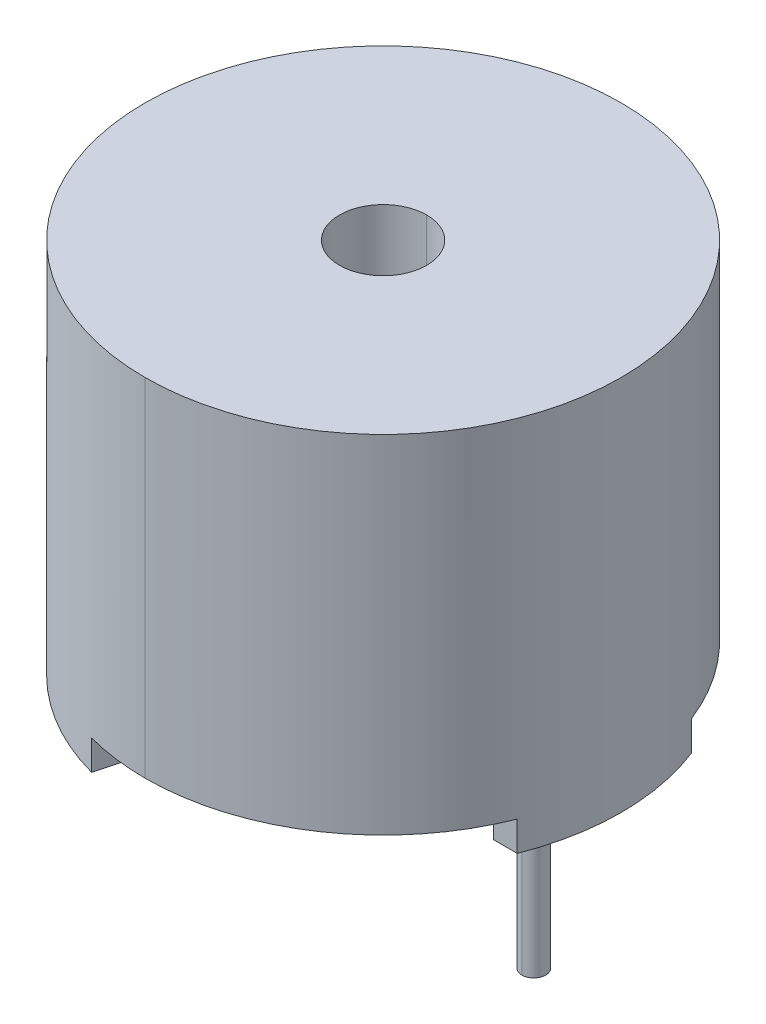
ISO-10303-21;
HEADER;
FILE_DESCRIPTION(('STEP AP214'),'2;1');
FILE_NAME('part.step','',(''),(''),'','','');
FILE_SCHEMA(('AUTOMOTIVE_DESIGN { 1 0 10303 214 1 1 1 1 }'));
ENDSEC;
DATA;
#1=APPLICATION_CONTEXT('core data for automotive mechanical design processes');
#2=APPLICATION_PROTOCOL_DEFINITION('international standard','automotive_design',2000,#1);
#3=PRODUCT_CONTEXT('',#1,'mechanical');
#4=PRODUCT('Part','Part','',(#3));
#5=PRODUCT_RELATED_PRODUCT_CATEGORY('part','',(#4));
#6=PRODUCT_DEFINITION_FORMATION('','',#4);
#7=PRODUCT_DEFINITION_CONTEXT('part definition',#1,'design');
#8=PRODUCT_DEFINITION('design','',#6,#7);
#9=PRODUCT_DEFINITION_SHAPE('','',#8);
#10=(LENGTH_UNIT() NAMED_UNIT(*) SI_UNIT(.MILLI.,.METRE.));
#11=(NAMED_UNIT(*) PLANE_ANGLE_UNIT() SI_UNIT($,.RADIAN.));
#12=(NAMED_UNIT(*) SI_UNIT($,.STERADIAN.) SOLID_ANGLE_UNIT());
#13=UNCERTAINTY_MEASURE_WITH_UNIT(LENGTH_MEASURE(1.E-05),#10,'distance_accuracy_value','');
#14=(GEOMETRIC_REPRESENTATION_CONTEXT(3) GLOBAL_UNCERTAINTY_ASSIGNED_CONTEXT((#13)) GLOBAL_UNIT_ASSIGNED_CONTEXT((#10,
#11,#12)) REPRESENTATION_CONTEXT('',''));
#15=CARTESIAN_POINT('',(0.,0.,0.));
#16=DIRECTION('',(0.,0.,1.));
#17=DIRECTION('',(1.,0.,0.));
#18=AXIS2_PLACEMENT_3D('',#15,#16,#17);
#19=CARTESIAN_POINT('',(-3.8,500000.,0.));
#20=DIRECTION('',(0.,-1.,0.));
#21=DIRECTION('',(0.,0.,-1.));
#22=AXIS2_PLACEMENT_3D('',#19,#20,#21);
#23=CYLINDRICAL_SURFACE('',#22,0.3);
#24=CARTESIAN_POINT('',(-3.8,0.749999999982265,0.));
#25=DIRECTION('',(0.,-1.,0.));
#26=DIRECTION('',(0.,0.,-1.));
#27=AXIS2_PLACEMENT_3D('',#24,#25,#26);
#28=CIRCLE('',#27,0.3);
#29=CARTESIAN_POINT('',(-3.8,0.749999999982265,-0.300000000000001));
#30=VERTEX_POINT('',#29);
#31=CARTESIAN_POINT('',(-3.8,0.749999999982265,0.299999999999999));
#32=VERTEX_POINT('',#31);
#33=EDGE_CURVE('E298',#30,#32,#28,.T.);
#34=ORIENTED_EDGE('',*,*,#33,.T.);
#35=DIRECTION('',(0.,-1.,0.));
#36=VECTOR('',#35,1.);
#37=CARTESIAN_POINT('',(-3.8,500000.,0.299999999999999));
#38=LINE('',#37,#36);
#39=CARTESIAN_POINT('',(-3.8,-3.5,0.299999999999999));
#40=VERTEX_POINT('',#39);
#41=EDGE_CURVE('E290',#32,#40,#38,.T.);
#42=ORIENTED_EDGE('',*,*,#41,.T.);
#43=CARTESIAN_POINT('',(-3.8,-3.5,0.));
#44=DIRECTION('',(0.,-1.,0.));
#45=DIRECTION('',(0.,0.,1.));
#46=AXIS2_PLACEMENT_3D('',#43,#44,#45);
#47=CIRCLE('',#46,0.3);
#48=CARTESIAN_POINT('',(-3.8,-3.5,-0.300000000000001));
#49=VERTEX_POINT('',#48);
#50=EDGE_CURVE('E181',#49,#40,#47,.T.);
#51=ORIENTED_EDGE('',*,*,#50,.F.);
#52=DIRECTION('',(0.,-1.,0.));
#53=VECTOR('',#52,1.);
#54=CARTESIAN_POINT('',(-3.8,500000.,-0.300000000000001));
#55=LINE('',#54,#53);
#56=EDGE_CURVE('E303',#30,#49,#55,.T.);
#57=ORIENTED_EDGE('',*,*,#56,.F.);
#58=EDGE_LOOP('',(#34,#42,#51,#57));
#59=FACE_BOUND('',#58,.T.);
#60=ADVANCED_FACE('F38',(#59),#23,.T.);
#61=CARTESIAN_POINT('',(3.8,500000.,0.));
#62=DIRECTION('',(0.,-1.,0.));
#63=DIRECTION('',(0.,0.,-1.));
#64=AXIS2_PLACEMENT_3D('',#61,#62,#63);
#65=CYLINDRICAL_SURFACE('',#64,0.3);
#66=CARTESIAN_POINT('',(3.8,0.749999999982265,0.));
#67=DIRECTION('',(0.,-1.,0.));
#68=DIRECTION('',(0.,0.,-1.));
#69=AXIS2_PLACEMENT_3D('',#66,#67,#68);
#70=CIRCLE('',#69,0.3);
#71=CARTESIAN_POINT('',(3.8,0.749999999982265,-0.3));
#72=VERTEX_POINT('',#71);
#73=CARTESIAN_POINT('',(3.8,0.749999999982265,0.3));
#74=VERTEX_POINT('',#73);
#75=EDGE_CURVE('E297',#72,#74,#70,.T.);
#76=ORIENTED_EDGE('',*,*,#75,.T.);
#77=DIRECTION('',(0.,-1.,0.));
#78=VECTOR('',#77,1.);
#79=CARTESIAN_POINT('',(3.8,500000.,0.3));
#80=LINE('',#79,#78);
#81=CARTESIAN_POINT('',(3.8,-4.5,0.3));
#82=VERTEX_POINT('',#81);
#83=EDGE_CURVE('E452',#74,#82,#80,.T.);
#84=ORIENTED_EDGE('',*,*,#83,.T.);
#85=CARTESIAN_POINT('',(3.8,-4.5,0.));
#86=DIRECTION('',(0.,-1.,0.));
#87=DIRECTION('',(0.,0.,-1.));
#88=AXIS2_PLACEMENT_3D('',#85,#86,#87);
#89=CIRCLE('',#88,0.3);
#90=CARTESIAN_POINT('',(3.8,-4.5,-0.3));
#91=VERTEX_POINT('',#90);
#92=EDGE_CURVE('E177',#91,#82,#89,.T.);
#93=ORIENTED_EDGE('',*,*,#92,.F.);
#94=DIRECTION('',(0.,-1.,0.));
#95=VECTOR('',#94,1.);
#96=CARTESIAN_POINT('',(3.8,500000.,-0.3));
#97=LINE('',#96,#95);
#98=EDGE_CURVE('E312',#72,#91,#97,.T.);
#99=ORIENTED_EDGE('',*,*,#98,.F.);
#100=EDGE_LOOP('',(#76,#84,#93,#99));
#101=FACE_BOUND('',#100,.T.);
#102=ADVANCED_FACE('F205',(#101),#65,.T.);
#103=CARTESIAN_POINT('',(0.,9.5,0.));
#104=DIRECTION('',(0.,-1.,0.));
#105=DIRECTION('',(0.,0.,-1.));
#106=AXIS2_PLACEMENT_3D('',#103,#104,#105);
#107=CYLINDRICAL_SURFACE('',#106,6.);
#108=CARTESIAN_POINT('',(0.,9.5,0.));
#109=DIRECTION('',(0.,1.,0.));
#110=DIRECTION('',(0.,0.,1.));
#111=AXIS2_PLACEMENT_3D('',#108,#109,#110);
#112=CIRCLE('',#111,6.);
#113=CARTESIAN_POINT('',(0.,9.5,6.));
#114=VERTEX_POINT('',#113);
#115=CARTESIAN_POINT('',(0.,9.5,-6.));
#116=VERTEX_POINT('',#115);
#117=EDGE_CURVE('E348',#114,#116,#112,.T.);
#118=ORIENTED_EDGE('',*,*,#117,.F.);
#119=DIRECTION('',(0.,-1.,0.));
#120=VECTOR('',#119,1.);
#121=CARTESIAN_POINT('',(0.,9.5,6.));
#122=LINE('',#121,#120);
#123=CARTESIAN_POINT('',(0.,0.750000000000001,6.));
#124=VERTEX_POINT('',#123);
#125=EDGE_CURVE('E379',#114,#124,#122,.T.);
#126=ORIENTED_EDGE('',*,*,#125,.T.);
#127=CARTESIAN_POINT('',(0.,0.750000000000001,0.));
#128=DIRECTION('',(0.,-1.,0.));
#129=DIRECTION('',(0.,0.,-1.));
#130=AXIS2_PLACEMENT_3D('',#127,#128,#129);
#131=CIRCLE('',#130,6.);
#132=CARTESIAN_POINT('',(5.58211429478115,0.75,2.2));
#133=VERTEX_POINT('',#132);
#134=EDGE_CURVE('E347',#133,#124,#131,.T.);
#135=ORIENTED_EDGE('',*,*,#134,.F.);
#136=DIRECTION('',(0.,-1.,0.));
#137=VECTOR('',#136,1.);
#138=CARTESIAN_POINT('',(5.58211429478115,0.75,2.2));
#139=LINE('',#138,#137);
#140=CARTESIAN_POINT('',(5.58211429478115,0.,2.2));
#141=VERTEX_POINT('',#140);
#142=EDGE_CURVE('E144',#133,#141,#139,.T.);
#143=ORIENTED_EDGE('',*,*,#142,.T.);
#144=CARTESIAN_POINT('',(0.,0.,0.));
#145=DIRECTION('',(0.,1.,0.));
#146=DIRECTION('',(0.,0.,1.));
#147=AXIS2_PLACEMENT_3D('',#144,#145,#146);
#148=CIRCLE('',#147,6.);
#149=CARTESIAN_POINT('',(5.58211429478115,0.,-2.2));
#150=VERTEX_POINT('',#149);
#151=EDGE_CURVE('E382',#141,#150,#148,.T.);
#152=ORIENTED_EDGE('',*,*,#151,.T.);
#153=DIRECTION('',(0.,-1.,0.));
#154=VECTOR('',#153,1.);
#155=CARTESIAN_POINT('',(5.58211429478115,0.75,-2.2));
#156=LINE('',#155,#154);
#157=CARTESIAN_POINT('',(5.58211429478115,0.75,-2.2));
#158=VERTEX_POINT('',#157);
#159=EDGE_CURVE('E151',#158,#150,#156,.T.);
#160=ORIENTED_EDGE('',*,*,#159,.F.);
#161=CARTESIAN_POINT('',(0.,0.750000000000001,0.));
#162=DIRECTION('',(0.,-1.,0.));
#163=DIRECTION('',(0.,0.,-1.));
#164=AXIS2_PLACEMENT_3D('',#161,#162,#163);
#165=CIRCLE('',#164,6.);
#166=CARTESIAN_POINT('',(0.,0.750000000000001,-6.));
#167=VERTEX_POINT('',#166);
#168=EDGE_CURVE('E134',#167,#158,#165,.T.);
#169=ORIENTED_EDGE('',*,*,#168,.F.);
#170=DIRECTION('',(0.,-1.,0.));
#171=VECTOR('',#170,1.);
#172=CARTESIAN_POINT('',(0.,9.5,-6.));
#173=LINE('',#172,#171);
#174=EDGE_CURVE('E336',#116,#167,#173,.T.);
#175=ORIENTED_EDGE('',*,*,#174,.F.);
#176=EDGE_LOOP('',(#118,#126,#135,#143,#152,#160,#169,#175));
#177=FACE_BOUND('',#176,.T.);
#178=ADVANCED_FACE('F211',(#177),#107,.T.);
#179=CARTESIAN_POINT('',(0.,0.,0.));
#180=DIRECTION('',(0.,1.,0.));
#181=DIRECTION('',(0.,0.,1.));
#182=AXIS2_PLACEMENT_3D('',#179,#180,#181);
#183=PLANE('',#182);
#184=DIRECTION('',(-1.,0.,0.));
#185=VECTOR('',#184,1.);
#186=CARTESIAN_POINT('',(5.58211429478115,0.,2.2));
#187=LINE('',#186,#185);
#188=CARTESIAN_POINT('',(4.98211429478115,0.,2.2));
#189=VERTEX_POINT('',#188);
#190=EDGE_CURVE('E385',#141,#189,#187,.T.);
#191=ORIENTED_EDGE('',*,*,#190,.T.);
#192=CARTESIAN_POINT('',(0.,0.,0.));
#193=DIRECTION('',(0.,1.,0.));
#194=DIRECTION('',(0.,0.,1.));
#195=AXIS2_PLACEMENT_3D('',#192,#193,#194);
#196=CIRCLE('',#195,5.44623382221721);
#197=CARTESIAN_POINT('',(4.98211429478115,0.,-2.2));
#198=VERTEX_POINT('',#197);
#199=EDGE_CURVE('E149',#189,#198,#196,.T.);
#200=ORIENTED_EDGE('',*,*,#199,.T.);
#201=DIRECTION('',(1.,0.,0.));
#202=VECTOR('',#201,1.);
#203=CARTESIAN_POINT('',(5.58211429478115,0.,-2.2));
#204=LINE('',#203,#202);
#205=EDGE_CURVE('E394',#198,#150,#204,.T.);
#206=ORIENTED_EDGE('',*,*,#205,.T.);
#207=ORIENTED_EDGE('',*,*,#151,.F.);
#208=EDGE_LOOP('',(#191,#200,#206,#207));
#209=FACE_BOUND('',#208,.T.);
#210=ADVANCED_FACE('F218',(#209),#183,.F.);
#211=CARTESIAN_POINT('',(0.,0.,0.));
#212=DIRECTION('',(0.,1.,0.));
#213=DIRECTION('',(0.,0.,1.));
#214=AXIS2_PLACEMENT_3D('',#211,#212,#213);
#215=PLANE('',#214);
#216=DIRECTION('',(-0.258819045102525,0.,0.965925826289067));
#217=VECTOR('',#216,1.);
#218=CARTESIAN_POINT('',(-1.55291427061515,0.,5.7955549577344));
#219=LINE('',#218,#217);
#220=CARTESIAN_POINT('',(-1.39762284355364,0.,5.21599946196096));
#221=VERTEX_POINT('',#220);
#222=CARTESIAN_POINT('',(-1.55291427061515,0.,5.7955549577344));
#223=VERTEX_POINT('',#222);
#224=EDGE_CURVE('E364',#221,#223,#219,.T.);
#225=ORIENTED_EDGE('',*,*,#224,.T.);
#226=CARTESIAN_POINT('',(0.,0.,0.));
#227=DIRECTION('',(0.,1.,0.));
#228=DIRECTION('',(0.,0.,1.));
#229=AXIS2_PLACEMENT_3D('',#226,#227,#228);
#230=CIRCLE('',#229,6.);
#231=CARTESIAN_POINT('',(-4.24264068711928,0.,4.24264068711929));
#232=VERTEX_POINT('',#231);
#233=EDGE_CURVE('E359',#232,#223,#230,.T.);
#234=ORIENTED_EDGE('',*,*,#233,.F.);
#235=DIRECTION('',(0.707106781186547,0.,-0.707106781186548));
#236=VECTOR('',#235,1.);
#237=CARTESIAN_POINT('',(-3.81837661840735,0.,3.81837661840736));
#238=LINE('',#237,#236);
#239=CARTESIAN_POINT('',(-3.81837661840735,0.,3.81837661840736));
#240=VERTEX_POINT('',#239);
#241=EDGE_CURVE('E398',#232,#240,#238,.T.);
#242=ORIENTED_EDGE('',*,*,#241,.T.);
#243=CARTESIAN_POINT('',(0.,0.,0.));
#244=DIRECTION('',(0.,1.,0.));
#245=DIRECTION('',(0.,0.,-1.));
#246=AXIS2_PLACEMENT_3D('',#243,#244,#245);
#247=CIRCLE('',#246,5.4);
#248=EDGE_CURVE('E402',#240,#221,#247,.T.);
#249=ORIENTED_EDGE('',*,*,#248,.T.);
#250=EDGE_LOOP('',(#225,#234,#242,#249));
#251=FACE_BOUND('',#250,.T.);
#252=ADVANCED_FACE('F222',(#251),#215,.F.);
#253=CARTESIAN_POINT('',(0.,0.,0.));
#254=DIRECTION('',(0.,1.,0.));
#255=DIRECTION('',(0.,0.,1.));
#256=AXIS2_PLACEMENT_3D('',#253,#254,#255);
#257=PLANE('',#256);
#258=DIRECTION('',(-0.707106781186546,0.,-0.707106781186549));
#259=VECTOR('',#258,1.);
#260=CARTESIAN_POINT('',(-3.81837661840735,0.,-3.81837661840737));
#261=LINE('',#260,#259);
#262=CARTESIAN_POINT('',(-3.81837661840735,0.,-3.81837661840737));
#263=VERTEX_POINT('',#262);
#264=CARTESIAN_POINT('',(-4.24264068711928,0.,-4.24264068711929));
#265=VERTEX_POINT('',#264);
#266=EDGE_CURVE('E75',#263,#265,#261,.T.);
#267=ORIENTED_EDGE('',*,*,#266,.T.);
#268=CARTESIAN_POINT('',(0.,0.,0.));
#269=DIRECTION('',(0.,1.,0.));
#270=DIRECTION('',(0.,0.,1.));
#271=AXIS2_PLACEMENT_3D('',#268,#269,#270);
#272=CIRCLE('',#271,6.);
#273=CARTESIAN_POINT('',(-1.55291427061515,0.,-5.79555495773441));
#274=VERTEX_POINT('',#273);
#275=EDGE_CURVE('E353',#274,#265,#272,.T.);
#276=ORIENTED_EDGE('',*,*,#275,.F.);
#277=DIRECTION('',(0.258819045102525,0.,0.965925826289067));
#278=VECTOR('',#277,1.);
#279=CARTESIAN_POINT('',(-1.55291427061515,0.,-5.79555495773441));
#280=LINE('',#279,#278);
#281=CARTESIAN_POINT('',(-1.39762284355363,0.,-5.21599946196097));
#282=VERTEX_POINT('',#281);
#283=EDGE_CURVE('E337',#274,#282,#280,.T.);
#284=ORIENTED_EDGE('',*,*,#283,.T.);
#285=CARTESIAN_POINT('',(0.,0.,0.));
#286=DIRECTION('',(0.,1.,0.));
#287=DIRECTION('',(0.,0.,1.));
#288=AXIS2_PLACEMENT_3D('',#285,#286,#287);
#289=CIRCLE('',#288,5.4);
#290=EDGE_CURVE('E335',#282,#263,#289,.T.);
#291=ORIENTED_EDGE('',*,*,#290,.T.);
#292=EDGE_LOOP('',(#267,#276,#284,#291));
#293=FACE_BOUND('',#292,.T.);
#294=ADVANCED_FACE('F226',(#293),#257,.F.);
#295=CARTESIAN_POINT('',(0.,9.5,0.));
#296=DIRECTION('',(0.,-1.,0.));
#297=DIRECTION('',(0.,0.,-1.));
#298=AXIS2_PLACEMENT_3D('',#295,#296,#297);
#299=CYLINDRICAL_SURFACE('',#298,6.);
#300=ORIENTED_EDGE('',*,*,#125,.F.);
#301=CARTESIAN_POINT('',(0.,9.5,0.));
#302=DIRECTION('',(0.,1.,0.));
#303=DIRECTION('',(0.,0.,1.));
#304=AXIS2_PLACEMENT_3D('',#301,#302,#303);
#305=CIRCLE('',#304,6.);
#306=EDGE_CURVE('E344',#116,#114,#305,.T.);
#307=ORIENTED_EDGE('',*,*,#306,.F.);
#308=ORIENTED_EDGE('',*,*,#174,.T.);
#309=CARTESIAN_POINT('',(0.,0.750000000000001,0.));
#310=DIRECTION('',(0.,-1.,0.));
#311=DIRECTION('',(0.,0.,-1.));
#312=AXIS2_PLACEMENT_3D('',#309,#310,#311);
#313=CIRCLE('',#312,6.);
#314=CARTESIAN_POINT('',(-1.55291427061515,0.75,-5.79555495773441));
#315=VERTEX_POINT('',#314);
#316=EDGE_CURVE('E349',#315,#167,#313,.T.);
#317=ORIENTED_EDGE('',*,*,#316,.F.);
#318=DIRECTION('',(0.,-1.,0.));
#319=VECTOR('',#318,1.);
#320=CARTESIAN_POINT('',(-1.55291427061515,0.75,-5.79555495773441));
#321=LINE('',#320,#319);
#322=EDGE_CURVE('E332',#315,#274,#321,.T.);
#323=ORIENTED_EDGE('',*,*,#322,.T.);
#324=ORIENTED_EDGE('',*,*,#275,.T.);
#325=DIRECTION('',(0.,-1.,0.));
#326=VECTOR('',#325,1.);
#327=CARTESIAN_POINT('',(-4.24264068711928,0.75,-4.24264068711929));
#328=LINE('',#327,#326);
#329=CARTESIAN_POINT('',(-4.24264068711928,0.75,-4.24264068711929));
#330=VERTEX_POINT('',#329);
#331=EDGE_CURVE('E323',#330,#265,#328,.T.);
#332=ORIENTED_EDGE('',*,*,#331,.F.);
#333=CARTESIAN_POINT('',(0.,0.750000000000001,0.));
#334=DIRECTION('',(0.,-1.,0.));
#335=DIRECTION('',(0.,0.,-1.));
#336=AXIS2_PLACEMENT_3D('',#333,#334,#335);
#337=CIRCLE('',#336,6.);
#338=CARTESIAN_POINT('',(-4.24264068711928,0.75,4.24264068711929));
#339=VERTEX_POINT('',#338);
#340=EDGE_CURVE('E351',#339,#330,#337,.T.);
#341=ORIENTED_EDGE('',*,*,#340,.F.);
#342=DIRECTION('',(0.,-1.,0.));
#343=VECTOR('',#342,1.);
#344=CARTESIAN_POINT('',(-4.24264068711928,0.75,4.24264068711929));
#345=LINE('',#344,#343);
#346=EDGE_CURVE('E357',#339,#232,#345,.T.);
#347=ORIENTED_EDGE('',*,*,#346,.T.);
#348=ORIENTED_EDGE('',*,*,#233,.T.);
#349=DIRECTION('',(0.,-1.,0.));
#350=VECTOR('',#349,1.);
#351=CARTESIAN_POINT('',(-1.55291427061515,0.75,5.7955549577344));
#352=LINE('',#351,#350);
#353=CARTESIAN_POINT('',(-1.55291427061515,0.75,5.7955549577344));
#354=VERTEX_POINT('',#353);
#355=EDGE_CURVE('E316',#354,#223,#352,.T.);
#356=ORIENTED_EDGE('',*,*,#355,.F.);
#357=CARTESIAN_POINT('',(0.,0.750000000000001,0.));
#358=DIRECTION('',(0.,-1.,0.));
#359=DIRECTION('',(0.,0.,-1.));
#360=AXIS2_PLACEMENT_3D('',#357,#358,#359);
#361=CIRCLE('',#360,6.);
#362=EDGE_CURVE('E308',#124,#354,#361,.T.);
#363=ORIENTED_EDGE('',*,*,#362,.F.);
#364=EDGE_LOOP('',(#300,#307,#308,#317,#323,#324,#332,#341,#347,#348,#356,#363));
#365=FACE_BOUND('',#364,.T.);
#366=ADVANCED_FACE('F230',(#365),#299,.T.);
#367=CARTESIAN_POINT('',(0.,9.5,0.));
#368=DIRECTION('',(0.,1.,0.));
#369=DIRECTION('',(0.,0.,1.));
#370=AXIS2_PLACEMENT_3D('',#367,#368,#369);
#371=PLANE('',#370);
#372=ORIENTED_EDGE('',*,*,#306,.T.);
#373=ORIENTED_EDGE('',*,*,#117,.T.);
#374=EDGE_LOOP('',(#372,#373));
#375=FACE_BOUND('',#374,.T.);
#376=CARTESIAN_POINT('',(0.,9.5,0.));
#377=DIRECTION('',(0.,1.,0.));
#378=DIRECTION('',(0.,0.,1.));
#379=AXIS2_PLACEMENT_3D('',#376,#377,#378);
#380=CIRCLE('',#379,1.1);
#381=CARTESIAN_POINT('',(0.,9.5,-1.1));
#382=VERTEX_POINT('',#381);
#383=CARTESIAN_POINT('',(0.,9.5,1.1));
#384=VERTEX_POINT('',#383);
#385=EDGE_CURVE('E67',#382,#384,#380,.T.);
#386=ORIENTED_EDGE('',*,*,#385,.F.);
#387=CARTESIAN_POINT('',(0.,9.5,0.));
#388=DIRECTION('',(0.,1.,0.));
#389=DIRECTION('',(0.,0.,1.));
#390=AXIS2_PLACEMENT_3D('',#387,#388,#389);
#391=CIRCLE('',#390,1.1);
#392=EDGE_CURVE('E11',#384,#382,#391,.T.);
#393=ORIENTED_EDGE('',*,*,#392,.F.);
#394=EDGE_LOOP('',(#386,#393));
#395=FACE_BOUND('',#394,.T.);
#396=ADVANCED_FACE('F234',(#375,#395),#371,.T.);
#397=CARTESIAN_POINT('',(0.274198215040875,0.75,0.));
#398=DIRECTION('',(0.,-1.,0.));
#399=DIRECTION('',(0.,0.,-1.));
#400=AXIS2_PLACEMENT_3D('',#397,#398,#399);
#401=PLANE('',#400);
#402=ORIENTED_EDGE('',*,*,#33,.F.);
#403=CARTESIAN_POINT('',(-3.8,0.749999999982265,0.));
#404=DIRECTION('',(0.,-1.,0.));
#405=DIRECTION('',(0.,0.,-1.));
#406=AXIS2_PLACEMENT_3D('',#403,#404,#405);
#407=CIRCLE('',#406,0.3);
#408=EDGE_CURVE('E176',#32,#30,#407,.T.);
#409=ORIENTED_EDGE('',*,*,#408,.F.);
#410=EDGE_LOOP('',(#402,#409));
#411=FACE_BOUND('',#410,.T.);
#412=ORIENTED_EDGE('',*,*,#75,.F.);
#413=CARTESIAN_POINT('',(3.8,0.749999999982265,0.));
#414=DIRECTION('',(0.,-1.,0.));
#415=DIRECTION('',(0.,0.,-1.));
#416=AXIS2_PLACEMENT_3D('',#413,#414,#415);
#417=CIRCLE('',#416,0.3);
#418=EDGE_CURVE('E172',#74,#72,#417,.T.);
#419=ORIENTED_EDGE('',*,*,#418,.F.);
#420=EDGE_LOOP('',(#412,#419));
#421=FACE_BOUND('',#420,.T.);
#422=ORIENTED_EDGE('',*,*,#134,.T.);
#423=ORIENTED_EDGE('',*,*,#362,.T.);
#424=DIRECTION('',(-0.258819045102525,0.,0.965925826289067));
#425=VECTOR('',#424,1.);
#426=CARTESIAN_POINT('',(-1.55291427061515,0.75,5.7955549577344));
#427=LINE('',#426,#425);
#428=CARTESIAN_POINT('',(-1.39762284355364,0.75,5.21599946196096));
#429=VERTEX_POINT('',#428);
#430=EDGE_CURVE('E313',#429,#354,#427,.T.);
#431=ORIENTED_EDGE('',*,*,#430,.F.);
#432=CARTESIAN_POINT('',(0.,0.75,0.));
#433=DIRECTION('',(0.,1.,0.));
#434=DIRECTION('',(0.,0.,-1.));
#435=AXIS2_PLACEMENT_3D('',#432,#433,#434);
#436=CIRCLE('',#435,5.4);
#437=CARTESIAN_POINT('',(-3.81837661840735,0.75,3.81837661840736));
#438=VERTEX_POINT('',#437);
#439=EDGE_CURVE('E159',#438,#429,#436,.T.);
#440=ORIENTED_EDGE('',*,*,#439,.F.);
#441=DIRECTION('',(0.707106781186547,0.,-0.707106781186548));
#442=VECTOR('',#441,1.);
#443=CARTESIAN_POINT('',(-3.81837661840735,0.75,3.81837661840736));
#444=LINE('',#443,#442);
#445=EDGE_CURVE('E158',#339,#438,#444,.T.);
#446=ORIENTED_EDGE('',*,*,#445,.F.);
#447=ORIENTED_EDGE('',*,*,#340,.T.);
#448=DIRECTION('',(-0.707106781186546,0.,-0.707106781186549));
#449=VECTOR('',#448,1.);
#450=CARTESIAN_POINT('',(-3.81837661840735,0.75,-3.81837661840737));
#451=LINE('',#450,#449);
#452=CARTESIAN_POINT('',(-3.81837661840735,0.75,-3.81837661840737));
#453=VERTEX_POINT('',#452);
#454=EDGE_CURVE('E163',#453,#330,#451,.T.);
#455=ORIENTED_EDGE('',*,*,#454,.F.);
#456=CARTESIAN_POINT('',(0.,0.75,0.));
#457=DIRECTION('',(0.,1.,0.));
#458=DIRECTION('',(0.,0.,1.));
#459=AXIS2_PLACEMENT_3D('',#456,#457,#458);
#460=CIRCLE('',#459,5.4);
#461=CARTESIAN_POINT('',(-1.39762284355363,0.75,-5.21599946196097));
#462=VERTEX_POINT('',#461);
#463=EDGE_CURVE('E168',#462,#453,#460,.T.);
#464=ORIENTED_EDGE('',*,*,#463,.F.);
#465=DIRECTION('',(0.258819045102525,0.,0.965925826289067));
#466=VECTOR('',#465,1.);
#467=CARTESIAN_POINT('',(-1.55291427061515,0.75,-5.79555495773441));
#468=LINE('',#467,#466);
#469=EDGE_CURVE('E167',#315,#462,#468,.T.);
#470=ORIENTED_EDGE('',*,*,#469,.F.);
#471=ORIENTED_EDGE('',*,*,#316,.T.);
#472=ORIENTED_EDGE('',*,*,#168,.T.);
#473=DIRECTION('',(1.,0.,0.));
#474=VECTOR('',#473,1.);
#475=CARTESIAN_POINT('',(5.58211429478115,0.75,-2.2));
#476=LINE('',#475,#474);
#477=CARTESIAN_POINT('',(4.98211429478115,0.75,-2.2));
#478=VERTEX_POINT('',#477);
#479=EDGE_CURVE('E120',#478,#158,#476,.T.);
#480=ORIENTED_EDGE('',*,*,#479,.F.);
#481=CARTESIAN_POINT('',(0.,0.75,0.));
#482=DIRECTION('',(0.,1.,0.));
#483=DIRECTION('',(0.,0.,1.));
#484=AXIS2_PLACEMENT_3D('',#481,#482,#483);
#485=CIRCLE('',#484,5.44623382221721);
#486=CARTESIAN_POINT('',(4.98211429478115,0.75,2.2));
#487=VERTEX_POINT('',#486);
#488=EDGE_CURVE('E123',#487,#478,#485,.T.);
#489=ORIENTED_EDGE('',*,*,#488,.F.);
#490=DIRECTION('',(-1.,0.,0.));
#491=VECTOR('',#490,1.);
#492=CARTESIAN_POINT('',(5.58211429478115,0.75,2.2));
#493=LINE('',#492,#491);
#494=EDGE_CURVE('E128',#133,#487,#493,.T.);
#495=ORIENTED_EDGE('',*,*,#494,.F.);
#496=EDGE_LOOP('',(#422,#423,#431,#440,#446,#447,#455,#464,#470,#471,#472,#480,#489,#495));
#497=FACE_BOUND('',#496,.T.);
#498=ADVANCED_FACE('F126',(#411,#421,#497),#401,.T.);
#499=CARTESIAN_POINT('',(0.,0.75,0.));
#500=DIRECTION('',(0.,-1.,0.));
#501=DIRECTION('',(0.,0.,-1.));
#502=AXIS2_PLACEMENT_3D('',#499,#500,#501);
#503=CYLINDRICAL_SURFACE('',#502,5.44623382221721);
#504=ORIENTED_EDGE('',*,*,#199,.F.);
#505=DIRECTION('',(0.,-1.,0.));
#506=VECTOR('',#505,1.);
#507=CARTESIAN_POINT('',(4.98211429478115,0.75,2.2));
#508=LINE('',#507,#506);
#509=EDGE_CURVE('E142',#487,#189,#508,.T.);
#510=ORIENTED_EDGE('',*,*,#509,.F.);
#511=ORIENTED_EDGE('',*,*,#488,.T.);
#512=DIRECTION('',(0.,-1.,0.));
#513=VECTOR('',#512,1.);
#514=CARTESIAN_POINT('',(4.98211429478115,0.75,-2.2));
#515=LINE('',#514,#513);
#516=EDGE_CURVE('E133',#478,#198,#515,.T.);
#517=ORIENTED_EDGE('',*,*,#516,.T.);
#518=EDGE_LOOP('',(#504,#510,#511,#517));
#519=FACE_BOUND('',#518,.T.);
#520=ADVANCED_FACE('F147',(#519),#503,.F.);
#521=CARTESIAN_POINT('',(5.58211429478115,0.75,2.2));
#522=DIRECTION('',(0.,0.,1.));
#523=DIRECTION('',(1.,0.,0.));
#524=AXIS2_PLACEMENT_3D('',#521,#522,#523);
#525=PLANE('',#524);
#526=ORIENTED_EDGE('',*,*,#190,.F.);
#527=ORIENTED_EDGE('',*,*,#142,.F.);
#528=ORIENTED_EDGE('',*,*,#494,.T.);
#529=ORIENTED_EDGE('',*,*,#509,.T.);
#530=EDGE_LOOP('',(#526,#527,#528,#529));
#531=FACE_BOUND('',#530,.T.);
#532=ADVANCED_FACE('F140',(#531),#525,.T.);
#533=CARTESIAN_POINT('',(5.58211429478115,0.75,-2.2));
#534=DIRECTION('',(0.,0.,-1.));
#535=DIRECTION('',(-1.,0.,0.));
#536=AXIS2_PLACEMENT_3D('',#533,#534,#535);
#537=PLANE('',#536);
#538=ORIENTED_EDGE('',*,*,#205,.F.);
#539=ORIENTED_EDGE('',*,*,#516,.F.);
#540=ORIENTED_EDGE('',*,*,#479,.T.);
#541=ORIENTED_EDGE('',*,*,#159,.T.);
#542=EDGE_LOOP('',(#538,#539,#540,#541));
#543=FACE_BOUND('',#542,.T.);
#544=ADVANCED_FACE('F246',(#543),#537,.T.);
#545=CARTESIAN_POINT('',(-1.55291427061515,0.75,5.79555495773441));
#546=DIRECTION('',(0.965925826289067,0.,0.258819045102525));
#547=DIRECTION('',(0.258819045102525,0.,-0.965925826289067));
#548=AXIS2_PLACEMENT_3D('',#545,#546,#547);
#549=PLANE('',#548);
#550=ORIENTED_EDGE('',*,*,#224,.F.);
#551=DIRECTION('',(0.,-1.,0.));
#552=VECTOR('',#551,1.);
#553=CARTESIAN_POINT('',(-1.39762284355364,0.75,5.21599946196096));
#554=LINE('',#553,#552);
#555=EDGE_CURVE('E155',#429,#221,#554,.T.);
#556=ORIENTED_EDGE('',*,*,#555,.F.);
#557=ORIENTED_EDGE('',*,*,#430,.T.);
#558=ORIENTED_EDGE('',*,*,#355,.T.);
#559=EDGE_LOOP('',(#550,#556,#557,#558));
#560=FACE_BOUND('',#559,.T.);
#561=ADVANCED_FACE('F249',(#560),#549,.T.);
#562=CARTESIAN_POINT('',(0.,0.75,0.));
#563=DIRECTION('',(0.,-1.,0.));
#564=DIRECTION('',(0.,0.,-1.));
#565=AXIS2_PLACEMENT_3D('',#562,#563,#564);
#566=CYLINDRICAL_SURFACE('',#565,5.4);
#567=ORIENTED_EDGE('',*,*,#248,.F.);
#568=DIRECTION('',(0.,-1.,0.));
#569=VECTOR('',#568,1.);
#570=CARTESIAN_POINT('',(-3.81837661840735,0.75,3.81837661840736));
#571=LINE('',#570,#569);
#572=EDGE_CURVE('E160',#438,#240,#571,.T.);
#573=ORIENTED_EDGE('',*,*,#572,.F.);
#574=ORIENTED_EDGE('',*,*,#439,.T.);
#575=ORIENTED_EDGE('',*,*,#555,.T.);
#576=EDGE_LOOP('',(#567,#573,#574,#575));
#577=FACE_BOUND('',#576,.T.);
#578=ADVANCED_FACE('F253',(#577),#566,.F.);
#579=CARTESIAN_POINT('',(-3.81837661840735,0.75,3.81837661840736));
#580=DIRECTION('',(-0.707106781186548,0.,-0.707106781186547));
#581=DIRECTION('',(-0.707106781186547,0.,0.707106781186548));
#582=AXIS2_PLACEMENT_3D('',#579,#580,#581);
#583=PLANE('',#582);
#584=ORIENTED_EDGE('',*,*,#241,.F.);
#585=ORIENTED_EDGE('',*,*,#346,.F.);
#586=ORIENTED_EDGE('',*,*,#445,.T.);
#587=ORIENTED_EDGE('',*,*,#572,.T.);
#588=EDGE_LOOP('',(#584,#585,#586,#587));
#589=FACE_BOUND('',#588,.T.);
#590=ADVANCED_FACE('F257',(#589),#583,.T.);
#591=CARTESIAN_POINT('',(-3.81837661840735,0.75,-3.81837661840737));
#592=DIRECTION('',(-0.707106781186549,0.,0.707106781186546));
#593=DIRECTION('',(0.707106781186546,0.,0.707106781186549));
#594=AXIS2_PLACEMENT_3D('',#591,#592,#593);
#595=PLANE('',#594);
#596=ORIENTED_EDGE('',*,*,#266,.F.);
#597=DIRECTION('',(0.,-1.,0.));
#598=VECTOR('',#597,1.);
#599=CARTESIAN_POINT('',(-3.81837661840735,0.75,-3.81837661840737));
#600=LINE('',#599,#598);
#601=EDGE_CURVE('E164',#453,#263,#600,.T.);
#602=ORIENTED_EDGE('',*,*,#601,.F.);
#603=ORIENTED_EDGE('',*,*,#454,.T.);
#604=ORIENTED_EDGE('',*,*,#331,.T.);
#605=EDGE_LOOP('',(#596,#602,#603,#604));
#606=FACE_BOUND('',#605,.T.);
#607=ADVANCED_FACE('F261',(#606),#595,.T.);
#608=CARTESIAN_POINT('',(0.,0.75,0.));
#609=DIRECTION('',(0.,-1.,0.));
#610=DIRECTION('',(0.,0.,-1.));
#611=AXIS2_PLACEMENT_3D('',#608,#609,#610);
#612=CYLINDRICAL_SURFACE('',#611,5.4);
#613=ORIENTED_EDGE('',*,*,#290,.F.);
#614=DIRECTION('',(0.,-1.,0.));
#615=VECTOR('',#614,1.);
#616=CARTESIAN_POINT('',(-1.39762284355363,0.75,-5.21599946196097));
#617=LINE('',#616,#615);
#618=EDGE_CURVE('E169',#462,#282,#617,.T.);
#619=ORIENTED_EDGE('',*,*,#618,.F.);
#620=ORIENTED_EDGE('',*,*,#463,.T.);
#621=ORIENTED_EDGE('',*,*,#601,.T.);
#622=EDGE_LOOP('',(#613,#619,#620,#621));
#623=FACE_BOUND('',#622,.T.);
#624=ADVANCED_FACE('F265',(#623),#612,.F.);
#625=CARTESIAN_POINT('',(-1.55291427061515,0.75,-5.79555495773441));
#626=DIRECTION('',(0.965925826289067,0.,-0.258819045102525));
#627=DIRECTION('',(-0.258819045102525,0.,-0.965925826289067));
#628=AXIS2_PLACEMENT_3D('',#625,#626,#627);
#629=PLANE('',#628);
#630=ORIENTED_EDGE('',*,*,#283,.F.);
#631=ORIENTED_EDGE('',*,*,#322,.F.);
#632=ORIENTED_EDGE('',*,*,#469,.T.);
#633=ORIENTED_EDGE('',*,*,#618,.T.);
#634=EDGE_LOOP('',(#630,#631,#632,#633));
#635=FACE_BOUND('',#634,.T.);
#636=ADVANCED_FACE('F268',(#635),#629,.T.);
#637=CARTESIAN_POINT('',(3.8,500000.,0.));
#638=DIRECTION('',(0.,-1.,0.));
#639=DIRECTION('',(0.,0.,-1.));
#640=AXIS2_PLACEMENT_3D('',#637,#638,#639);
#641=CYLINDRICAL_SURFACE('',#640,0.3);
#642=ORIENTED_EDGE('',*,*,#83,.F.);
#643=ORIENTED_EDGE('',*,*,#418,.T.);
#644=ORIENTED_EDGE('',*,*,#98,.T.);
#645=CARTESIAN_POINT('',(3.8,-4.5,0.));
#646=DIRECTION('',(0.,-1.,0.));
#647=DIRECTION('',(0.,0.,-1.));
#648=AXIS2_PLACEMENT_3D('',#645,#646,#647);
#649=CIRCLE('',#648,0.3);
#650=EDGE_CURVE('E173',#82,#91,#649,.T.);
#651=ORIENTED_EDGE('',*,*,#650,.F.);
#652=EDGE_LOOP('',(#642,#643,#644,#651));
#653=FACE_BOUND('',#652,.T.);
#654=ADVANCED_FACE('F272',(#653),#641,.T.);
#655=CARTESIAN_POINT('',(3.8,-4.5,0.));
#656=DIRECTION('',(0.,-1.,0.));
#657=DIRECTION('',(0.,0.,-1.));
#658=AXIS2_PLACEMENT_3D('',#655,#656,#657);
#659=PLANE('',#658);
#660=ORIENTED_EDGE('',*,*,#92,.T.);
#661=ORIENTED_EDGE('',*,*,#650,.T.);
#662=EDGE_LOOP('',(#660,#661));
#663=FACE_BOUND('',#662,.T.);
#664=ADVANCED_FACE('F276',(#663),#659,.T.);
#665=CARTESIAN_POINT('',(-3.8,500000.,0.));
#666=DIRECTION('',(0.,-1.,0.));
#667=DIRECTION('',(0.,0.,-1.));
#668=AXIS2_PLACEMENT_3D('',#665,#666,#667);
#669=CYLINDRICAL_SURFACE('',#668,0.3);
#670=ORIENTED_EDGE('',*,*,#41,.F.);
#671=ORIENTED_EDGE('',*,*,#408,.T.);
#672=ORIENTED_EDGE('',*,*,#56,.T.);
#673=CARTESIAN_POINT('',(-3.8,-3.5,0.));
#674=DIRECTION('',(0.,-1.,0.));
#675=DIRECTION('',(0.,0.,1.));
#676=AXIS2_PLACEMENT_3D('',#673,#674,#675);
#677=CIRCLE('',#676,0.3);
#678=EDGE_CURVE('E178',#40,#49,#677,.T.);
#679=ORIENTED_EDGE('',*,*,#678,.F.);
#680=EDGE_LOOP('',(#670,#671,#672,#679));
#681=FACE_BOUND('',#680,.T.);
#682=ADVANCED_FACE('F201',(#681),#669,.T.);
#683=CARTESIAN_POINT('',(0.,-3.5,0.));
#684=DIRECTION('',(0.,1.,0.));
#685=DIRECTION('',(0.,0.,1.));
#686=AXIS2_PLACEMENT_3D('',#683,#684,#685);
#687=PLANE('',#686);
#688=ORIENTED_EDGE('',*,*,#50,.T.);
#689=ORIENTED_EDGE('',*,*,#678,.T.);
#690=EDGE_LOOP('',(#688,#689));
#691=FACE_BOUND('',#690,.T.);
#692=ADVANCED_FACE('F195',(#691),#687,.F.);
#693=CARTESIAN_POINT('',(0.,6.5,0.));
#694=DIRECTION('',(0.,1.,0.));
#695=DIRECTION('',(0.,0.,1.));
#696=AXIS2_PLACEMENT_3D('',#693,#694,#695);
#697=CYLINDRICAL_SURFACE('',#696,1.1);
#698=CARTESIAN_POINT('',(0.,6.5,0.));
#699=DIRECTION('',(0.,1.,0.));
#700=DIRECTION('',(0.,0.,1.));
#701=AXIS2_PLACEMENT_3D('',#698,#699,#700);
#702=CIRCLE('',#701,1.1);
#703=CARTESIAN_POINT('',(0.,6.5,-1.1));
#704=VERTEX_POINT('',#703);
#705=CARTESIAN_POINT('',(0.,6.5,1.1));
#706=VERTEX_POINT('',#705);
#707=EDGE_CURVE('E182',#704,#706,#702,.T.);
#708=ORIENTED_EDGE('',*,*,#707,.F.);
#709=DIRECTION('',(0.,1.,0.));
#710=VECTOR('',#709,1.);
#711=CARTESIAN_POINT('',(0.,6.5,-1.1));
#712=LINE('',#711,#710);
#713=EDGE_CURVE('E54',#704,#382,#712,.T.);
#714=ORIENTED_EDGE('',*,*,#713,.T.);
#715=ORIENTED_EDGE('',*,*,#385,.T.);
#716=DIRECTION('',(0.,1.,0.));
#717=VECTOR('',#716,1.);
#718=CARTESIAN_POINT('',(0.,6.5,1.1));
#719=LINE('',#718,#717);
#720=EDGE_CURVE('E47',#706,#384,#719,.T.);
#721=ORIENTED_EDGE('',*,*,#720,.F.);
#722=EDGE_LOOP('',(#708,#714,#715,#721));
#723=FACE_BOUND('',#722,.T.);
#724=ADVANCED_FACE('F193',(#723),#697,.F.);
#725=CARTESIAN_POINT('',(0.,6.5,0.));
#726=DIRECTION('',(0.,1.,0.));
#727=DIRECTION('',(0.,0.,1.));
#728=AXIS2_PLACEMENT_3D('',#725,#726,#727);
#729=PLANE('',#728);
#730=CARTESIAN_POINT('',(0.,6.5,0.));
#731=DIRECTION('',(0.,1.,0.));
#732=DIRECTION('',(0.,0.,1.));
#733=AXIS2_PLACEMENT_3D('',#730,#731,#732);
#734=CIRCLE('',#733,1.1);
#735=EDGE_CURVE('E185',#706,#704,#734,.T.);
#736=ORIENTED_EDGE('',*,*,#735,.T.);
#737=ORIENTED_EDGE('',*,*,#707,.T.);
#738=EDGE_LOOP('',(#736,#737));
#739=FACE_BOUND('',#738,.T.);
#740=ADVANCED_FACE('F191',(#739),#729,.T.);
#741=CARTESIAN_POINT('',(0.,6.5,0.));
#742=DIRECTION('',(0.,1.,0.));
#743=DIRECTION('',(0.,0.,1.));
#744=AXIS2_PLACEMENT_3D('',#741,#742,#743);
#745=CYLINDRICAL_SURFACE('',#744,1.1);
#746=ORIENTED_EDGE('',*,*,#713,.F.);
#747=ORIENTED_EDGE('',*,*,#735,.F.);
#748=ORIENTED_EDGE('',*,*,#720,.T.);
#749=ORIENTED_EDGE('',*,*,#392,.T.);
#750=EDGE_LOOP('',(#746,#747,#748,#749));
#751=FACE_BOUND('',#750,.T.);
#752=ADVANCED_FACE('F40',(#751),#745,.F.);
#753=CLOSED_SHELL('',(#60,#102,#178,#210,#252,#294,#366,#396,#498,#520,#532,#544,#561,#578,#590,
#607,#624,#636,#654,#664,#682,#692,#724,#740,#752));
#754=MANIFOLD_SOLID_BREP('B2',#753);
#755=ADVANCED_BREP_SHAPE_REPRESENTATION('',(#18,#754),#14);
#756=SHAPE_DEFINITION_REPRESENTATION(#9,#755);
ENDSEC;
END-ISO-10303-21;
